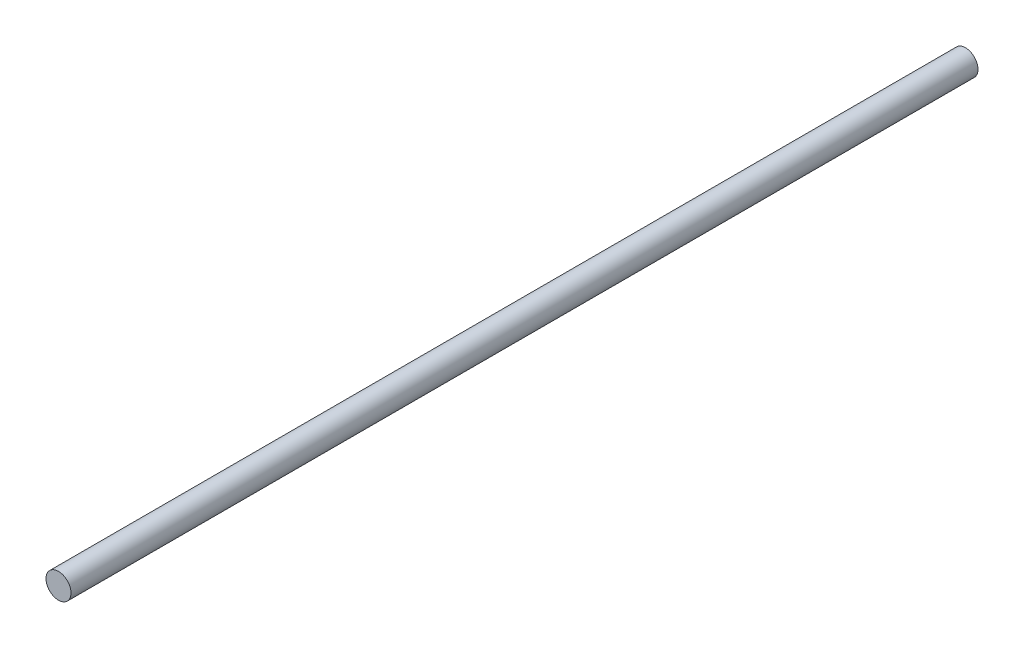
ISO-10303-21;
HEADER;
FILE_DESCRIPTION(('STEP AP214'),'2;1');
FILE_NAME('part.step','',(''),(''),'','','');
FILE_SCHEMA(('AUTOMOTIVE_DESIGN { 1 0 10303 214 1 1 1 1 }'));
ENDSEC;
DATA;
#1=APPLICATION_CONTEXT('core data for automotive mechanical design processes');
#2=APPLICATION_PROTOCOL_DEFINITION('international standard','automotive_design',2000,#1);
#3=PRODUCT_CONTEXT('',#1,'mechanical');
#4=PRODUCT('Part','Part','',(#3));
#5=PRODUCT_RELATED_PRODUCT_CATEGORY('part','',(#4));
#6=PRODUCT_DEFINITION_FORMATION('','',#4);
#7=PRODUCT_DEFINITION_CONTEXT('part definition',#1,'design');
#8=PRODUCT_DEFINITION('design','',#6,#7);
#9=PRODUCT_DEFINITION_SHAPE('','',#8);
#10=(LENGTH_UNIT() NAMED_UNIT(*) SI_UNIT(.MILLI.,.METRE.));
#11=(NAMED_UNIT(*) PLANE_ANGLE_UNIT() SI_UNIT($,.RADIAN.));
#12=(NAMED_UNIT(*) SI_UNIT($,.STERADIAN.) SOLID_ANGLE_UNIT());
#13=UNCERTAINTY_MEASURE_WITH_UNIT(LENGTH_MEASURE(1.E-05),#10,'distance_accuracy_value','');
#14=(GEOMETRIC_REPRESENTATION_CONTEXT(3) GLOBAL_UNCERTAINTY_ASSIGNED_CONTEXT((#13)) GLOBAL_UNIT_ASSIGNED_CONTEXT((#10,
#11,#12)) REPRESENTATION_CONTEXT('',''));
#15=CARTESIAN_POINT('',(0.,0.,0.));
#16=DIRECTION('',(0.,0.,1.));
#17=DIRECTION('',(1.,0.,0.));
#18=AXIS2_PLACEMENT_3D('',#15,#16,#17);
#19=CARTESIAN_POINT('',(0.,0.,290.));
#20=DIRECTION('',(0.,0.,-1.));
#21=DIRECTION('',(-1.,0.,0.));
#22=AXIS2_PLACEMENT_3D('',#19,#20,#21);
#23=CYLINDRICAL_SURFACE('',#22,4.);
#24=CARTESIAN_POINT('',(0.,0.,290.));
#25=DIRECTION('',(0.,0.,1.));
#26=DIRECTION('',(1.,0.,0.));
#27=AXIS2_PLACEMENT_3D('',#24,#25,#26);
#28=CIRCLE('',#27,4.);
#29=CARTESIAN_POINT('',(4.,0.,290.));
#30=VERTEX_POINT('',#29);
#31=EDGE_CURVE('E10',#30,#30,#28,.T.);
#32=ORIENTED_EDGE('',*,*,#31,.F.);
#33=EDGE_LOOP('',(#32));
#34=FACE_BOUND('',#33,.T.);
#35=CARTESIAN_POINT('',(0.,0.,0.));
#36=DIRECTION('',(0.,0.,1.));
#37=DIRECTION('',(1.,0.,0.));
#38=AXIS2_PLACEMENT_3D('',#35,#36,#37);
#39=CIRCLE('',#38,4.);
#40=CARTESIAN_POINT('',(4.,0.,0.));
#41=VERTEX_POINT('',#40);
#42=EDGE_CURVE('E34',#41,#41,#39,.T.);
#43=ORIENTED_EDGE('',*,*,#42,.T.);
#44=EDGE_LOOP('',(#43));
#45=FACE_BOUND('',#44,.T.);
#46=ADVANCED_FACE('F31',(#34,#45),#23,.T.);
#47=CARTESIAN_POINT('',(0.,0.,290.));
#48=DIRECTION('',(0.,0.,1.));
#49=DIRECTION('',(1.,0.,0.));
#50=AXIS2_PLACEMENT_3D('',#47,#48,#49);
#51=PLANE('',#50);
#52=ORIENTED_EDGE('',*,*,#31,.T.);
#53=EDGE_LOOP('',(#52));
#54=FACE_BOUND('',#53,.T.);
#55=ADVANCED_FACE('F46',(#54),#51,.T.);
#56=CARTESIAN_POINT('',(0.,0.,0.));
#57=DIRECTION('',(0.,0.,1.));
#58=DIRECTION('',(1.,0.,0.));
#59=AXIS2_PLACEMENT_3D('',#56,#57,#58);
#60=PLANE('',#59);
#61=ORIENTED_EDGE('',*,*,#42,.F.);
#62=EDGE_LOOP('',(#61));
#63=FACE_BOUND('',#62,.T.);
#64=ADVANCED_FACE('F44',(#63),#60,.F.);
#65=CLOSED_SHELL('',(#46,#55,#64));
#66=MANIFOLD_SOLID_BREP('B2',#65);
#67=ADVANCED_BREP_SHAPE_REPRESENTATION('',(#18,#66),#14);
#68=SHAPE_DEFINITION_REPRESENTATION(#9,#67);
ENDSEC;
END-ISO-10303-21;
